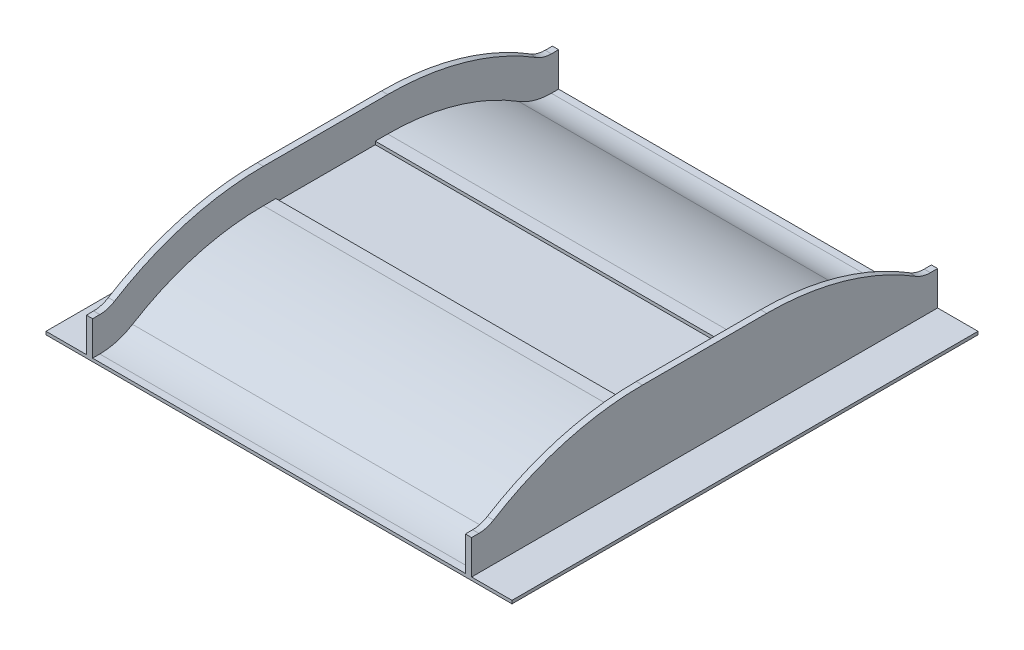
ISO-10303-21;
HEADER;
FILE_DESCRIPTION(('STEP AP214'),'2;1');
FILE_NAME('part.step','',(''),(''),'','','');
FILE_SCHEMA(('AUTOMOTIVE_DESIGN { 1 0 10303 214 1 1 1 1 }'));
ENDSEC;
DATA;
#1=APPLICATION_CONTEXT('core data for automotive mechanical design processes');
#2=APPLICATION_PROTOCOL_DEFINITION('international standard','automotive_design',2000,#1);
#3=PRODUCT_CONTEXT('',#1,'mechanical');
#4=PRODUCT('Part','Part','',(#3));
#5=PRODUCT_RELATED_PRODUCT_CATEGORY('part','',(#4));
#6=PRODUCT_DEFINITION_FORMATION('','',#4);
#7=PRODUCT_DEFINITION_CONTEXT('part definition',#1,'design');
#8=PRODUCT_DEFINITION('design','',#6,#7);
#9=PRODUCT_DEFINITION_SHAPE('','',#8);
#10=(LENGTH_UNIT() NAMED_UNIT(*) SI_UNIT(.MILLI.,.METRE.));
#11=(NAMED_UNIT(*) PLANE_ANGLE_UNIT() SI_UNIT($,.RADIAN.));
#12=(NAMED_UNIT(*) SI_UNIT($,.STERADIAN.) SOLID_ANGLE_UNIT());
#13=UNCERTAINTY_MEASURE_WITH_UNIT(LENGTH_MEASURE(1.E-05),#10,'distance_accuracy_value','');
#14=(GEOMETRIC_REPRESENTATION_CONTEXT(3) GLOBAL_UNCERTAINTY_ASSIGNED_CONTEXT((#13)) GLOBAL_UNIT_ASSIGNED_CONTEXT((#10,
#11,#12)) REPRESENTATION_CONTEXT('',''));
#15=CARTESIAN_POINT('',(0.,0.,0.));
#16=DIRECTION('',(0.,0.,1.));
#17=DIRECTION('',(1.,0.,0.));
#18=AXIS2_PLACEMENT_3D('',#15,#16,#17);
#19=CARTESIAN_POINT('',(2211.28446930371,160.,-3.21673368540825E-13));
#20=DIRECTION('',(0.,-1.,0.));
#21=DIRECTION('',(0.,0.,-1.));
#22=AXIS2_PLACEMENT_3D('',#19,#20,#21);
#23=PLANE('',#22);
#24=DIRECTION('',(0.,0.,1.));
#25=VECTOR('',#24,1.);
#26=CARTESIAN_POINT('',(600.,160.,-6.27465539184419E-13));
#27=LINE('',#26,#25);
#28=CARTESIAN_POINT('',(600.,160.,160.));
#29=VERTEX_POINT('',#28);
#30=CARTESIAN_POINT('',(600.,160.,200.));
#31=VERTEX_POINT('',#30);
#32=EDGE_CURVE('E369',#29,#31,#27,.T.);
#33=ORIENTED_EDGE('',*,*,#32,.F.);
#34=DIRECTION('',(1.,0.,0.));
#35=VECTOR('',#34,1.);
#36=CARTESIAN_POINT('',(-600.,160.,160.));
#37=LINE('',#36,#35);
#38=CARTESIAN_POINT('',(-600.,160.,160.));
#39=VERTEX_POINT('',#38);
#40=EDGE_CURVE('E55',#39,#29,#37,.T.);
#41=ORIENTED_EDGE('',*,*,#40,.F.);
#42=DIRECTION('',(0.,0.,-1.));
#43=VECTOR('',#42,1.);
#44=CARTESIAN_POINT('',(-600.,160.,2.11856741469169E-13));
#45=LINE('',#44,#43);
#46=CARTESIAN_POINT('',(-600.,160.,200.));
#47=VERTEX_POINT('',#46);
#48=EDGE_CURVE('E447',#47,#39,#45,.T.);
#49=ORIENTED_EDGE('',*,*,#48,.F.);
#50=DIRECTION('',(-1.,0.,0.));
#51=VECTOR('',#50,1.);
#52=CARTESIAN_POINT('',(2211.28446930371,160.,200.));
#53=LINE('',#52,#51);
#54=EDGE_CURVE('E469',#31,#47,#53,.T.);
#55=ORIENTED_EDGE('',*,*,#54,.F.);
#56=EDGE_LOOP('',(#33,#41,#49,#55));
#57=FACE_BOUND('',#56,.T.);
#58=ADVANCED_FACE('F40',(#57),#23,.F.);
#59=CARTESIAN_POINT('',(0.,10.,0.));
#60=DIRECTION('',(0.,1.,0.));
#61=DIRECTION('',(0.,0.,1.));
#62=AXIS2_PLACEMENT_3D('',#59,#60,#61);
#63=PLANE('',#62);
#64=DIRECTION('',(1.,0.,0.));
#65=VECTOR('',#64,1.);
#66=CARTESIAN_POINT('',(-750.,10.,750.));
#67=LINE('',#66,#65);
#68=CARTESIAN_POINT('',(-600.,10.,750.));
#69=VERTEX_POINT('',#68);
#70=CARTESIAN_POINT('',(600.,10.,750.));
#71=VERTEX_POINT('',#70);
#72=EDGE_CURVE('E490',#69,#71,#67,.T.);
#73=ORIENTED_EDGE('',*,*,#72,.T.);
#74=DIRECTION('',(0.,0.,1.));
#75=VECTOR('',#74,1.);
#76=CARTESIAN_POINT('',(600.,10.,1.1470400727364E-13));
#77=LINE('',#76,#75);
#78=CARTESIAN_POINT('',(600.,10.0000000000001,726.782687642637));
#79=VERTEX_POINT('',#78);
#80=EDGE_CURVE('E63',#79,#71,#77,.T.);
#81=ORIENTED_EDGE('',*,*,#80,.F.);
#82=DIRECTION('',(-1.,0.,0.));
#83=VECTOR('',#82,1.);
#84=CARTESIAN_POINT('',(2211.28446930371,10.0000000000001,726.782687642636));
#85=LINE('',#84,#83);
#86=CARTESIAN_POINT('',(-600.,10.,726.782687642637));
#87=VERTEX_POINT('',#86);
#88=EDGE_CURVE('E462',#79,#87,#85,.T.);
#89=ORIENTED_EDGE('',*,*,#88,.T.);
#90=DIRECTION('',(0.,0.,1.));
#91=VECTOR('',#90,1.);
#92=CARTESIAN_POINT('',(-600.,10.,1.1470400727364E-13));
#93=LINE('',#92,#91);
#94=EDGE_CURVE('E399',#87,#69,#93,.T.);
#95=ORIENTED_EDGE('',*,*,#94,.T.);
#96=EDGE_LOOP('',(#73,#81,#89,#95));
#97=FACE_BOUND('',#96,.T.);
#98=ADVANCED_FACE('F587',(#97),#63,.T.);
#99=DIRECTION('',(-1.,0.,0.));
#100=VECTOR('',#99,1.);
#101=CARTESIAN_POINT('',(2211.28446930371,10.0000000000001,-726.782687642637));
#102=LINE('',#101,#100);
#103=CARTESIAN_POINT('',(600.,10.0000000000001,-726.782687642637));
#104=VERTEX_POINT('',#103);
#105=CARTESIAN_POINT('',(-600.,10.,-726.782687642637));
#106=VERTEX_POINT('',#105);
#107=EDGE_CURVE('E460',#104,#106,#102,.T.);
#108=ORIENTED_EDGE('',*,*,#107,.F.);
#109=CARTESIAN_POINT('',(600.,10.,-750.));
#110=VERTEX_POINT('',#109);
#111=EDGE_CURVE('E303',#110,#104,#77,.T.);
#112=ORIENTED_EDGE('',*,*,#111,.F.);
#113=DIRECTION('',(-1.,0.,0.));
#114=VECTOR('',#113,1.);
#115=CARTESIAN_POINT('',(-750.,10.,-750.));
#116=LINE('',#115,#114);
#117=CARTESIAN_POINT('',(-600.,10.,-750.));
#118=VERTEX_POINT('',#117);
#119=EDGE_CURVE('E483',#110,#118,#116,.T.);
#120=ORIENTED_EDGE('',*,*,#119,.T.);
#121=EDGE_CURVE('E400',#118,#106,#93,.T.);
#122=ORIENTED_EDGE('',*,*,#121,.T.);
#123=EDGE_LOOP('',(#108,#112,#120,#122));
#124=FACE_BOUND('',#123,.T.);
#125=ADVANCED_FACE('F533',(#124),#63,.T.);
#126=CARTESIAN_POINT('',(2211.28446930371,210.,726.782687642637));
#127=DIRECTION('',(-1.,0.,0.));
#128=DIRECTION('',(0.,0.,1.));
#129=AXIS2_PLACEMENT_3D('',#126,#127,#128);
#130=CYLINDRICAL_SURFACE('',#129,200.);
#131=CARTESIAN_POINT('',(600.,210.,726.782687642637));
#132=DIRECTION('',(1.,0.,0.));
#133=DIRECTION('',(0.,0.,-1.));
#134=AXIS2_PLACEMENT_3D('',#131,#132,#133);
#135=CIRCLE('',#134,200.);
#136=CARTESIAN_POINT('',(600.,40.0000000000005,621.42615011411));
#137=VERTEX_POINT('',#136);
#138=EDGE_CURVE('E374',#137,#79,#135,.F.);
#139=ORIENTED_EDGE('',*,*,#138,.F.);
#140=DIRECTION('',(-1.,0.,0.));
#141=VECTOR('',#140,1.);
#142=CARTESIAN_POINT('',(2211.28446930371,40.0000000000005,621.42615011411));
#143=LINE('',#142,#141);
#144=CARTESIAN_POINT('',(-600.,40.0000000000006,621.42615011411));
#145=VERTEX_POINT('',#144);
#146=EDGE_CURVE('E471',#137,#145,#143,.T.);
#147=ORIENTED_EDGE('',*,*,#146,.T.);
#148=CARTESIAN_POINT('',(-600.,210.,726.782687642637));
#149=DIRECTION('',(-1.,0.,0.));
#150=DIRECTION('',(0.,0.,1.));
#151=AXIS2_PLACEMENT_3D('',#148,#149,#150);
#152=CIRCLE('',#151,200.);
#153=EDGE_CURVE('E453',#87,#145,#152,.F.);
#154=ORIENTED_EDGE('',*,*,#153,.F.);
#155=ORIENTED_EDGE('',*,*,#88,.F.);
#156=EDGE_LOOP('',(#139,#147,#154,#155));
#157=FACE_BOUND('',#156,.T.);
#158=ADVANCED_FACE('F591',(#157),#130,.F.);
#159=CARTESIAN_POINT('',(2211.28446930371,-640.,200.));
#160=DIRECTION('',(-1.,0.,0.));
#161=DIRECTION('',(0.,0.,1.));
#162=AXIS2_PLACEMENT_3D('',#159,#160,#161);
#163=CYLINDRICAL_SURFACE('',#162,800.000000000001);
#164=ORIENTED_EDGE('',*,*,#146,.F.);
#165=CARTESIAN_POINT('',(600.,-640.,200.));
#166=DIRECTION('',(1.,0.,0.));
#167=DIRECTION('',(0.,0.,-1.));
#168=AXIS2_PLACEMENT_3D('',#165,#166,#167);
#169=CIRCLE('',#168,800.000000000001);
#170=EDGE_CURVE('E371',#137,#31,#169,.F.);
#171=ORIENTED_EDGE('',*,*,#170,.T.);
#172=ORIENTED_EDGE('',*,*,#54,.T.);
#173=CARTESIAN_POINT('',(-600.,-640.,200.));
#174=DIRECTION('',(-1.,0.,0.));
#175=DIRECTION('',(0.,0.,1.));
#176=AXIS2_PLACEMENT_3D('',#173,#174,#175);
#177=CIRCLE('',#176,800.000000000001);
#178=EDGE_CURVE('E450',#47,#145,#177,.F.);
#179=ORIENTED_EDGE('',*,*,#178,.T.);
#180=EDGE_LOOP('',(#164,#171,#172,#179));
#181=FACE_BOUND('',#180,.T.);
#182=ADVANCED_FACE('F594',(#181),#163,.T.);
#183=CARTESIAN_POINT('',(-600.,160.,-160.));
#184=VERTEX_POINT('',#183);
#185=CARTESIAN_POINT('',(-600.,160.,-200.));
#186=VERTEX_POINT('',#185);
#187=EDGE_CURVE('E446',#184,#186,#45,.T.);
#188=ORIENTED_EDGE('',*,*,#187,.F.);
#189=DIRECTION('',(-1.,0.,0.));
#190=VECTOR('',#189,1.);
#191=CARTESIAN_POINT('',(-600.,160.,-160.));
#192=LINE('',#191,#190);
#193=CARTESIAN_POINT('',(600.,160.,-160.));
#194=VERTEX_POINT('',#193);
#195=EDGE_CURVE('E287',#194,#184,#192,.T.);
#196=ORIENTED_EDGE('',*,*,#195,.F.);
#197=CARTESIAN_POINT('',(600.,160.,-200.));
#198=VERTEX_POINT('',#197);
#199=EDGE_CURVE('E269',#198,#194,#27,.T.);
#200=ORIENTED_EDGE('',*,*,#199,.F.);
#201=DIRECTION('',(-1.,0.,0.));
#202=VECTOR('',#201,1.);
#203=CARTESIAN_POINT('',(2211.28446930371,160.,-200.));
#204=LINE('',#203,#202);
#205=EDGE_CURVE('E466',#198,#186,#204,.T.);
#206=ORIENTED_EDGE('',*,*,#205,.T.);
#207=EDGE_LOOP('',(#188,#196,#200,#206));
#208=FACE_BOUND('',#207,.T.);
#209=ADVANCED_FACE('F603',(#208),#23,.F.);
#210=CARTESIAN_POINT('',(2211.28446930371,-640.,-200.));
#211=DIRECTION('',(-1.,0.,0.));
#212=DIRECTION('',(0.,0.,1.));
#213=AXIS2_PLACEMENT_3D('',#210,#211,#212);
#214=CYLINDRICAL_SURFACE('',#213,800.);
#215=CARTESIAN_POINT('',(600.,-640.,-200.));
#216=DIRECTION('',(1.,0.,0.));
#217=DIRECTION('',(0.,0.,-1.));
#218=AXIS2_PLACEMENT_3D('',#215,#216,#217);
#219=CIRCLE('',#218,800.);
#220=CARTESIAN_POINT('',(600.,40.,-621.42615011411));
#221=VERTEX_POINT('',#220);
#222=EDGE_CURVE('E367',#221,#198,#219,.T.);
#223=ORIENTED_EDGE('',*,*,#222,.F.);
#224=DIRECTION('',(-1.,0.,0.));
#225=VECTOR('',#224,1.);
#226=CARTESIAN_POINT('',(2211.28446930371,40.,-621.42615011411));
#227=LINE('',#226,#225);
#228=CARTESIAN_POINT('',(-600.,39.9999999999998,-621.426150114109));
#229=VERTEX_POINT('',#228);
#230=EDGE_CURVE('E464',#221,#229,#227,.T.);
#231=ORIENTED_EDGE('',*,*,#230,.T.);
#232=CARTESIAN_POINT('',(-600.,-640.,-200.));
#233=DIRECTION('',(-1.,0.,0.));
#234=DIRECTION('',(0.,0.,1.));
#235=AXIS2_PLACEMENT_3D('',#232,#233,#234);
#236=CIRCLE('',#235,800.);
#237=EDGE_CURVE('E427',#186,#229,#236,.T.);
#238=ORIENTED_EDGE('',*,*,#237,.F.);
#239=ORIENTED_EDGE('',*,*,#205,.F.);
#240=EDGE_LOOP('',(#223,#231,#238,#239));
#241=FACE_BOUND('',#240,.T.);
#242=ADVANCED_FACE('F606',(#241),#214,.T.);
#243=CARTESIAN_POINT('',(2211.28446930371,210.,-726.782687642637));
#244=DIRECTION('',(-1.,0.,0.));
#245=DIRECTION('',(0.,0.,1.));
#246=AXIS2_PLACEMENT_3D('',#243,#244,#245);
#247=CYLINDRICAL_SURFACE('',#246,200.);
#248=ORIENTED_EDGE('',*,*,#230,.F.);
#249=CARTESIAN_POINT('',(600.,210.,-726.782687642637));
#250=DIRECTION('',(1.,0.,0.));
#251=DIRECTION('',(0.,0.,-1.));
#252=AXIS2_PLACEMENT_3D('',#249,#250,#251);
#253=CIRCLE('',#252,200.);
#254=EDGE_CURVE('E351',#221,#104,#253,.T.);
#255=ORIENTED_EDGE('',*,*,#254,.T.);
#256=ORIENTED_EDGE('',*,*,#107,.T.);
#257=CARTESIAN_POINT('',(-600.,210.,-726.782687642637));
#258=DIRECTION('',(-1.,0.,0.));
#259=DIRECTION('',(0.,0.,1.));
#260=AXIS2_PLACEMENT_3D('',#257,#258,#259);
#261=CIRCLE('',#260,200.);
#262=EDGE_CURVE('E12',#106,#229,#261,.T.);
#263=ORIENTED_EDGE('',*,*,#262,.T.);
#264=EDGE_LOOP('',(#248,#255,#256,#263));
#265=FACE_BOUND('',#264,.T.);
#266=ADVANCED_FACE('F545',(#265),#247,.F.);
#267=DIRECTION('',(0.,0.,-1.));
#268=VECTOR('',#267,1.);
#269=CARTESIAN_POINT('',(620.,10.0000000000001,0.));
#270=LINE('',#269,#268);
#271=CARTESIAN_POINT('',(620.,10.,750.));
#272=VERTEX_POINT('',#271);
#273=CARTESIAN_POINT('',(620.,10.,-750.));
#274=VERTEX_POINT('',#273);
#275=EDGE_CURVE('E457',#272,#274,#270,.T.);
#276=ORIENTED_EDGE('',*,*,#275,.F.);
#277=CARTESIAN_POINT('',(750.,10.,750.));
#278=VERTEX_POINT('',#277);
#279=EDGE_CURVE('E485',#272,#278,#67,.T.);
#280=ORIENTED_EDGE('',*,*,#279,.T.);
#281=DIRECTION('',(0.,0.,-1.));
#282=VECTOR('',#281,1.);
#283=CARTESIAN_POINT('',(750.,10.,-750.));
#284=LINE('',#283,#282);
#285=CARTESIAN_POINT('',(750.,10.,-750.));
#286=VERTEX_POINT('',#285);
#287=EDGE_CURVE('E474',#278,#286,#284,.T.);
#288=ORIENTED_EDGE('',*,*,#287,.T.);
#289=EDGE_CURVE('E479',#286,#274,#116,.T.);
#290=ORIENTED_EDGE('',*,*,#289,.T.);
#291=EDGE_LOOP('',(#276,#280,#288,#290));
#292=FACE_BOUND('',#291,.T.);
#293=ADVANCED_FACE('F613',(#292),#63,.T.);
#294=CARTESIAN_POINT('',(750.,10.,-750.));
#295=DIRECTION('',(-1.,0.,0.));
#296=DIRECTION('',(0.,0.,1.));
#297=AXIS2_PLACEMENT_3D('',#294,#295,#296);
#298=PLANE('',#297);
#299=DIRECTION('',(0.,0.,-1.));
#300=VECTOR('',#299,1.);
#301=CARTESIAN_POINT('',(750.,0.,-750.));
#302=LINE('',#301,#300);
#303=CARTESIAN_POINT('',(750.,0.,750.));
#304=VERTEX_POINT('',#303);
#305=CARTESIAN_POINT('',(750.,0.,-750.));
#306=VERTEX_POINT('',#305);
#307=EDGE_CURVE('E459',#304,#306,#302,.T.);
#308=ORIENTED_EDGE('',*,*,#307,.T.);
#309=DIRECTION('',(0.,-1.,0.));
#310=VECTOR('',#309,1.);
#311=CARTESIAN_POINT('',(750.,10.,-750.));
#312=LINE('',#311,#310);
#313=EDGE_CURVE('E48',#286,#306,#312,.T.);
#314=ORIENTED_EDGE('',*,*,#313,.F.);
#315=ORIENTED_EDGE('',*,*,#287,.F.);
#316=DIRECTION('',(0.,-1.,0.));
#317=VECTOR('',#316,1.);
#318=CARTESIAN_POINT('',(750.,10.,750.));
#319=LINE('',#318,#317);
#320=EDGE_CURVE('E489',#278,#304,#319,.T.);
#321=ORIENTED_EDGE('',*,*,#320,.T.);
#322=EDGE_LOOP('',(#308,#314,#315,#321));
#323=FACE_BOUND('',#322,.T.);
#324=ADVANCED_FACE('F42',(#323),#298,.F.);
#325=CARTESIAN_POINT('',(-750.,10.,-750.));
#326=DIRECTION('',(0.,0.,1.));
#327=DIRECTION('',(1.,0.,0.));
#328=AXIS2_PLACEMENT_3D('',#325,#326,#327);
#329=PLANE('',#328);
#330=DIRECTION('',(-1.,0.,0.));
#331=VECTOR('',#330,1.);
#332=CARTESIAN_POINT('',(-750.,0.,-750.));
#333=LINE('',#332,#331);
#334=CARTESIAN_POINT('',(-750.,0.,-750.));
#335=VERTEX_POINT('',#334);
#336=EDGE_CURVE('E493',#306,#335,#333,.T.);
#337=ORIENTED_EDGE('',*,*,#336,.T.);
#338=DIRECTION('',(0.,-1.,0.));
#339=VECTOR('',#338,1.);
#340=CARTESIAN_POINT('',(-750.,10.,-750.));
#341=LINE('',#340,#339);
#342=CARTESIAN_POINT('',(-750.,10.,-750.));
#343=VERTEX_POINT('',#342);
#344=EDGE_CURVE('E503',#343,#335,#341,.T.);
#345=ORIENTED_EDGE('',*,*,#344,.F.);
#346=CARTESIAN_POINT('',(-620.,10.,-750.));
#347=VERTEX_POINT('',#346);
#348=EDGE_CURVE('E477',#347,#343,#116,.T.);
#349=ORIENTED_EDGE('',*,*,#348,.F.);
#350=DIRECTION('',(0.,-1.,0.));
#351=VECTOR('',#350,1.);
#352=CARTESIAN_POINT('',(-620.,0.,-750.));
#353=LINE('',#352,#351);
#354=CARTESIAN_POINT('',(-620.,120.,-750.));
#355=VERTEX_POINT('',#354);
#356=EDGE_CURVE('E381',#355,#347,#353,.T.);
#357=ORIENTED_EDGE('',*,*,#356,.F.);
#358=DIRECTION('',(-1.,0.,0.));
#359=VECTOR('',#358,1.);
#360=CARTESIAN_POINT('',(-600.,120.,-750.));
#361=LINE('',#360,#359);
#362=CARTESIAN_POINT('',(-600.,120.,-750.));
#363=VERTEX_POINT('',#362);
#364=EDGE_CURVE('E425',#363,#355,#361,.T.);
#365=ORIENTED_EDGE('',*,*,#364,.F.);
#366=DIRECTION('',(0.,-1.,0.));
#367=VECTOR('',#366,1.);
#368=CARTESIAN_POINT('',(-600.,0.,-750.));
#369=LINE('',#368,#367);
#370=EDGE_CURVE('E396',#363,#118,#369,.T.);
#371=ORIENTED_EDGE('',*,*,#370,.T.);
#372=ORIENTED_EDGE('',*,*,#119,.F.);
#373=DIRECTION('',(0.,-1.,0.));
#374=VECTOR('',#373,1.);
#375=CARTESIAN_POINT('',(600.,0.,-750.));
#376=LINE('',#375,#374);
#377=CARTESIAN_POINT('',(600.,120.,-750.));
#378=VERTEX_POINT('',#377);
#379=EDGE_CURVE('E306',#378,#110,#376,.T.);
#380=ORIENTED_EDGE('',*,*,#379,.F.);
#381=DIRECTION('',(1.,0.,0.));
#382=VECTOR('',#381,1.);
#383=CARTESIAN_POINT('',(600.,120.,-750.));
#384=LINE('',#383,#382);
#385=CARTESIAN_POINT('',(620.,120.,-750.));
#386=VERTEX_POINT('',#385);
#387=EDGE_CURVE('E364',#378,#386,#384,.T.);
#388=ORIENTED_EDGE('',*,*,#387,.T.);
#389=DIRECTION('',(0.,-1.,0.));
#390=VECTOR('',#389,1.);
#391=CARTESIAN_POINT('',(620.,0.,-750.));
#392=LINE('',#391,#390);
#393=EDGE_CURVE('E328',#386,#274,#392,.T.);
#394=ORIENTED_EDGE('',*,*,#393,.T.);
#395=ORIENTED_EDGE('',*,*,#289,.F.);
#396=ORIENTED_EDGE('',*,*,#313,.T.);
#397=EDGE_LOOP('',(#337,#345,#349,#357,#365,#371,#372,#380,#388,#394,#395,#396));
#398=FACE_BOUND('',#397,.T.);
#399=ADVANCED_FACE('F508',(#398),#329,.F.);
#400=CARTESIAN_POINT('',(-750.,10.,-750.));
#401=DIRECTION('',(1.,0.,0.));
#402=DIRECTION('',(0.,0.,-1.));
#403=AXIS2_PLACEMENT_3D('',#400,#401,#402);
#404=PLANE('',#403);
#405=DIRECTION('',(0.,0.,1.));
#406=VECTOR('',#405,1.);
#407=CARTESIAN_POINT('',(-750.,0.,-750.));
#408=LINE('',#407,#406);
#409=CARTESIAN_POINT('',(-750.,0.,750.));
#410=VERTEX_POINT('',#409);
#411=EDGE_CURVE('E495',#335,#410,#408,.T.);
#412=ORIENTED_EDGE('',*,*,#411,.T.);
#413=DIRECTION('',(0.,-1.,0.));
#414=VECTOR('',#413,1.);
#415=CARTESIAN_POINT('',(-750.,10.,750.));
#416=LINE('',#415,#414);
#417=CARTESIAN_POINT('',(-750.,10.,750.));
#418=VERTEX_POINT('',#417);
#419=EDGE_CURVE('E500',#418,#410,#416,.T.);
#420=ORIENTED_EDGE('',*,*,#419,.F.);
#421=DIRECTION('',(0.,0.,1.));
#422=VECTOR('',#421,1.);
#423=CARTESIAN_POINT('',(-750.,10.,-750.));
#424=LINE('',#423,#422);
#425=EDGE_CURVE('E482',#343,#418,#424,.T.);
#426=ORIENTED_EDGE('',*,*,#425,.F.);
#427=ORIENTED_EDGE('',*,*,#344,.T.);
#428=EDGE_LOOP('',(#412,#420,#426,#427));
#429=FACE_BOUND('',#428,.T.);
#430=ADVANCED_FACE('F520',(#429),#404,.F.);
#431=CARTESIAN_POINT('',(-750.,10.,750.));
#432=DIRECTION('',(0.,0.,-1.));
#433=DIRECTION('',(-1.,0.,0.));
#434=AXIS2_PLACEMENT_3D('',#431,#432,#433);
#435=PLANE('',#434);
#436=DIRECTION('',(1.,0.,0.));
#437=VECTOR('',#436,1.);
#438=CARTESIAN_POINT('',(-750.,0.,750.));
#439=LINE('',#438,#437);
#440=EDGE_CURVE('E478',#410,#304,#439,.T.);
#441=ORIENTED_EDGE('',*,*,#440,.T.);
#442=ORIENTED_EDGE('',*,*,#320,.F.);
#443=ORIENTED_EDGE('',*,*,#279,.F.);
#444=DIRECTION('',(0.,-1.,0.));
#445=VECTOR('',#444,1.);
#446=CARTESIAN_POINT('',(620.,0.,750.));
#447=LINE('',#446,#445);
#448=CARTESIAN_POINT('',(620.,120.,750.));
#449=VERTEX_POINT('',#448);
#450=EDGE_CURVE('E295',#449,#272,#447,.T.);
#451=ORIENTED_EDGE('',*,*,#450,.F.);
#452=DIRECTION('',(1.,0.,0.));
#453=VECTOR('',#452,1.);
#454=CARTESIAN_POINT('',(600.,120.,750.));
#455=LINE('',#454,#453);
#456=CARTESIAN_POINT('',(600.,120.,750.));
#457=VERTEX_POINT('',#456);
#458=EDGE_CURVE('E349',#457,#449,#455,.T.);
#459=ORIENTED_EDGE('',*,*,#458,.F.);
#460=DIRECTION('',(0.,-1.,0.));
#461=VECTOR('',#460,1.);
#462=CARTESIAN_POINT('',(600.,0.,750.));
#463=LINE('',#462,#461);
#464=EDGE_CURVE('E299',#457,#71,#463,.T.);
#465=ORIENTED_EDGE('',*,*,#464,.T.);
#466=ORIENTED_EDGE('',*,*,#72,.F.);
#467=DIRECTION('',(0.,-1.,0.));
#468=VECTOR('',#467,1.);
#469=CARTESIAN_POINT('',(-600.,0.,750.));
#470=LINE('',#469,#468);
#471=CARTESIAN_POINT('',(-600.,120.,750.));
#472=VERTEX_POINT('',#471);
#473=EDGE_CURVE('E378',#472,#69,#470,.T.);
#474=ORIENTED_EDGE('',*,*,#473,.F.);
#475=DIRECTION('',(-1.,0.,0.));
#476=VECTOR('',#475,1.);
#477=CARTESIAN_POINT('',(-600.,120.,750.));
#478=LINE('',#477,#476);
#479=CARTESIAN_POINT('',(-620.,120.,750.));
#480=VERTEX_POINT('',#479);
#481=EDGE_CURVE('E403',#472,#480,#478,.T.);
#482=ORIENTED_EDGE('',*,*,#481,.T.);
#483=DIRECTION('',(0.,-1.,0.));
#484=VECTOR('',#483,1.);
#485=CARTESIAN_POINT('',(-620.,0.,750.));
#486=LINE('',#485,#484);
#487=CARTESIAN_POINT('',(-620.,10.,750.));
#488=VERTEX_POINT('',#487);
#489=EDGE_CURVE('E377',#480,#488,#486,.T.);
#490=ORIENTED_EDGE('',*,*,#489,.T.);
#491=EDGE_CURVE('E486',#418,#488,#67,.T.);
#492=ORIENTED_EDGE('',*,*,#491,.F.);
#493=ORIENTED_EDGE('',*,*,#419,.T.);
#494=EDGE_LOOP('',(#441,#442,#443,#451,#459,#465,#466,#474,#482,#490,#492,#493));
#495=FACE_BOUND('',#494,.T.);
#496=ADVANCED_FACE('F524',(#495),#435,.F.);
#497=DIRECTION('',(0.,0.,1.));
#498=VECTOR('',#497,1.);
#499=CARTESIAN_POINT('',(-620.,10.0000000000001,0.));
#500=LINE('',#499,#498);
#501=EDGE_CURVE('E456',#347,#488,#500,.T.);
#502=ORIENTED_EDGE('',*,*,#501,.F.);
#503=ORIENTED_EDGE('',*,*,#348,.T.);
#504=ORIENTED_EDGE('',*,*,#425,.T.);
#505=ORIENTED_EDGE('',*,*,#491,.T.);
#506=EDGE_LOOP('',(#502,#503,#504,#505));
#507=FACE_BOUND('',#506,.T.);
#508=ADVANCED_FACE('F527',(#507),#63,.T.);
#509=CARTESIAN_POINT('',(0.,0.,0.));
#510=DIRECTION('',(0.,1.,0.));
#511=DIRECTION('',(0.,0.,1.));
#512=AXIS2_PLACEMENT_3D('',#509,#510,#511);
#513=PLANE('',#512);
#514=ORIENTED_EDGE('',*,*,#307,.F.);
#515=ORIENTED_EDGE('',*,*,#440,.F.);
#516=ORIENTED_EDGE('',*,*,#411,.F.);
#517=ORIENTED_EDGE('',*,*,#336,.F.);
#518=EDGE_LOOP('',(#514,#515,#516,#517));
#519=FACE_BOUND('',#518,.T.);
#520=ADVANCED_FACE('F516',(#519),#513,.F.);
#521=CARTESIAN_POINT('',(-620.,0.,0.));
#522=DIRECTION('',(-1.,0.,0.));
#523=DIRECTION('',(0.,0.,1.));
#524=AXIS2_PLACEMENT_3D('',#521,#522,#523);
#525=PLANE('',#524);
#526=ORIENTED_EDGE('',*,*,#501,.T.);
#527=ORIENTED_EDGE('',*,*,#489,.F.);
#528=DIRECTION('',(0.,0.,1.));
#529=VECTOR('',#528,1.);
#530=CARTESIAN_POINT('',(-620.,120.,1.17664602005974E-13));
#531=LINE('',#530,#529);
#532=CARTESIAN_POINT('',(-620.,120.,726.782687642637));
#533=VERTEX_POINT('',#532);
#534=EDGE_CURVE('E406',#533,#480,#531,.T.);
#535=ORIENTED_EDGE('',*,*,#534,.F.);
#536=CARTESIAN_POINT('',(-620.,210.,726.782687642637));
#537=DIRECTION('',(-1.,0.,0.));
#538=DIRECTION('',(0.,0.,1.));
#539=AXIS2_PLACEMENT_3D('',#536,#537,#538);
#540=CIRCLE('',#539,89.9999999999997);
#541=CARTESIAN_POINT('',(-620.,133.5,679.3722457548));
#542=VERTEX_POINT('',#541);
#543=EDGE_CURVE('E408',#542,#533,#540,.T.);
#544=ORIENTED_EDGE('',*,*,#543,.F.);
#545=CARTESIAN_POINT('',(-620.,-640.,200.));
#546=DIRECTION('',(-1.,0.,0.));
#547=DIRECTION('',(0.,0.,1.));
#548=AXIS2_PLACEMENT_3D('',#545,#546,#547);
#549=CIRCLE('',#548,910.);
#550=CARTESIAN_POINT('',(-620.,270.,200.));
#551=VERTEX_POINT('',#550);
#552=EDGE_CURVE('E411',#542,#551,#549,.T.);
#553=ORIENTED_EDGE('',*,*,#552,.T.);
#554=DIRECTION('',(0.,0.,1.));
#555=VECTOR('',#554,1.);
#556=CARTESIAN_POINT('',(-620.,270.,-1.0715556048062E-13));
#557=LINE('',#556,#555);
#558=CARTESIAN_POINT('',(-620.,270.,-200.));
#559=VERTEX_POINT('',#558);
#560=EDGE_CURVE('E414',#559,#551,#557,.T.);
#561=ORIENTED_EDGE('',*,*,#560,.F.);
#562=CARTESIAN_POINT('',(-620.,-640.,-200.));
#563=DIRECTION('',(-1.,0.,0.));
#564=DIRECTION('',(0.,0.,1.));
#565=AXIS2_PLACEMENT_3D('',#562,#563,#564);
#566=CIRCLE('',#565,910.);
#567=CARTESIAN_POINT('',(-620.,133.5,-679.3722457548));
#568=VERTEX_POINT('',#567);
#569=EDGE_CURVE('E417',#559,#568,#566,.T.);
#570=ORIENTED_EDGE('',*,*,#569,.T.);
#571=CARTESIAN_POINT('',(-620.,210.,-726.782687642637));
#572=DIRECTION('',(-1.,0.,0.));
#573=DIRECTION('',(0.,0.,1.));
#574=AXIS2_PLACEMENT_3D('',#571,#572,#573);
#575=CIRCLE('',#574,89.9999999999999);
#576=CARTESIAN_POINT('',(-620.,120.,-726.782687642637));
#577=VERTEX_POINT('',#576);
#578=EDGE_CURVE('E420',#577,#568,#575,.T.);
#579=ORIENTED_EDGE('',*,*,#578,.F.);
#580=EDGE_CURVE('E409',#355,#577,#531,.T.);
#581=ORIENTED_EDGE('',*,*,#580,.F.);
#582=ORIENTED_EDGE('',*,*,#356,.T.);
#583=EDGE_LOOP('',(#526,#527,#535,#544,#553,#561,#570,#579,#581,#582));
#584=FACE_BOUND('',#583,.T.);
#585=ADVANCED_FACE('F629',(#584),#525,.T.);
#586=CARTESIAN_POINT('',(620.,10.,-750.));
#587=DIRECTION('',(-1.,0.,0.));
#588=DIRECTION('',(0.,0.,1.));
#589=AXIS2_PLACEMENT_3D('',#586,#587,#588);
#590=PLANE('',#589);
#591=ORIENTED_EDGE('',*,*,#450,.T.);
#592=ORIENTED_EDGE('',*,*,#275,.T.);
#593=ORIENTED_EDGE('',*,*,#393,.F.);
#594=DIRECTION('',(0.,0.,1.));
#595=VECTOR('',#594,1.);
#596=CARTESIAN_POINT('',(620.,120.,1.17664602005974E-13));
#597=LINE('',#596,#595);
#598=CARTESIAN_POINT('',(620.,120.,-726.782687642637));
#599=VERTEX_POINT('',#598);
#600=EDGE_CURVE('E331',#386,#599,#597,.T.);
#601=ORIENTED_EDGE('',*,*,#600,.T.);
#602=CARTESIAN_POINT('',(620.,210.,-726.782687642637));
#603=DIRECTION('',(-1.,0.,0.));
#604=DIRECTION('',(0.,0.,1.));
#605=AXIS2_PLACEMENT_3D('',#602,#603,#604);
#606=CIRCLE('',#605,89.9999999999999);
#607=CARTESIAN_POINT('',(620.,133.5,-679.3722457548));
#608=VERTEX_POINT('',#607);
#609=EDGE_CURVE('E334',#599,#608,#606,.T.);
#610=ORIENTED_EDGE('',*,*,#609,.T.);
#611=CARTESIAN_POINT('',(620.,-640.,-200.));
#612=DIRECTION('',(-1.,0.,0.));
#613=DIRECTION('',(0.,0.,1.));
#614=AXIS2_PLACEMENT_3D('',#611,#612,#613);
#615=CIRCLE('',#614,910.);
#616=CARTESIAN_POINT('',(620.,270.,-200.));
#617=VERTEX_POINT('',#616);
#618=EDGE_CURVE('E337',#617,#608,#615,.T.);
#619=ORIENTED_EDGE('',*,*,#618,.F.);
#620=DIRECTION('',(0.,0.,1.));
#621=VECTOR('',#620,1.);
#622=CARTESIAN_POINT('',(620.,270.,-1.0715556048062E-13));
#623=LINE('',#622,#621);
#624=CARTESIAN_POINT('',(620.,270.,200.));
#625=VERTEX_POINT('',#624);
#626=EDGE_CURVE('E340',#617,#625,#623,.T.);
#627=ORIENTED_EDGE('',*,*,#626,.T.);
#628=CARTESIAN_POINT('',(620.,-640.,200.));
#629=DIRECTION('',(-1.,0.,0.));
#630=DIRECTION('',(0.,0.,1.));
#631=AXIS2_PLACEMENT_3D('',#628,#629,#630);
#632=CIRCLE('',#631,910.);
#633=CARTESIAN_POINT('',(620.,133.5,679.3722457548));
#634=VERTEX_POINT('',#633);
#635=EDGE_CURVE('E343',#634,#625,#632,.T.);
#636=ORIENTED_EDGE('',*,*,#635,.F.);
#637=CARTESIAN_POINT('',(620.,210.,726.782687642637));
#638=DIRECTION('',(-1.,0.,0.));
#639=DIRECTION('',(0.,0.,1.));
#640=AXIS2_PLACEMENT_3D('',#637,#638,#639);
#641=CIRCLE('',#640,89.9999999999997);
#642=CARTESIAN_POINT('',(620.,120.,726.782687642637));
#643=VERTEX_POINT('',#642);
#644=EDGE_CURVE('E346',#634,#643,#641,.T.);
#645=ORIENTED_EDGE('',*,*,#644,.T.);
#646=EDGE_CURVE('E302',#643,#449,#597,.T.);
#647=ORIENTED_EDGE('',*,*,#646,.T.);
#648=EDGE_LOOP('',(#591,#592,#593,#601,#610,#619,#627,#636,#645,#647));
#649=FACE_BOUND('',#648,.T.);
#650=ADVANCED_FACE('F553',(#649),#590,.F.);
#651=CARTESIAN_POINT('',(-600.,120.,1.1470400727364E-13));
#652=DIRECTION('',(0.,-1.,0.));
#653=DIRECTION('',(0.,0.,-1.));
#654=AXIS2_PLACEMENT_3D('',#651,#652,#653);
#655=PLANE('',#654);
#656=ORIENTED_EDGE('',*,*,#580,.T.);
#657=DIRECTION('',(-1.,0.,0.));
#658=VECTOR('',#657,1.);
#659=CARTESIAN_POINT('',(-600.,120.,-726.782687642637));
#660=LINE('',#659,#658);
#661=CARTESIAN_POINT('',(-600.,120.,-726.782687642637));
#662=VERTEX_POINT('',#661);
#663=EDGE_CURVE('E428',#662,#577,#660,.T.);
#664=ORIENTED_EDGE('',*,*,#663,.F.);
#665=DIRECTION('',(0.,0.,1.));
#666=VECTOR('',#665,1.);
#667=CARTESIAN_POINT('',(-600.,120.,1.1470400727364E-13));
#668=LINE('',#667,#666);
#669=EDGE_CURVE('E384',#363,#662,#668,.T.);
#670=ORIENTED_EDGE('',*,*,#669,.F.);
#671=ORIENTED_EDGE('',*,*,#364,.T.);
#672=EDGE_LOOP('',(#656,#664,#670,#671));
#673=FACE_BOUND('',#672,.T.);
#674=ADVANCED_FACE('F705',(#673),#655,.F.);
#675=CARTESIAN_POINT('',(-600.,210.,-726.782687642637));
#676=DIRECTION('',(-1.,0.,0.));
#677=DIRECTION('',(0.,0.,1.));
#678=AXIS2_PLACEMENT_3D('',#675,#676,#677);
#679=CYLINDRICAL_SURFACE('',#678,89.9999999999999);
#680=ORIENTED_EDGE('',*,*,#578,.T.);
#681=DIRECTION('',(-1.,0.,0.));
#682=VECTOR('',#681,1.);
#683=CARTESIAN_POINT('',(-600.,133.5,-679.3722457548));
#684=LINE('',#683,#682);
#685=CARTESIAN_POINT('',(-600.,133.5,-679.3722457548));
#686=VERTEX_POINT('',#685);
#687=EDGE_CURVE('E431',#686,#568,#684,.T.);
#688=ORIENTED_EDGE('',*,*,#687,.F.);
#689=CARTESIAN_POINT('',(-600.,210.,-726.782687642637));
#690=DIRECTION('',(-1.,0.,0.));
#691=DIRECTION('',(0.,0.,1.));
#692=AXIS2_PLACEMENT_3D('',#689,#690,#691);
#693=CIRCLE('',#692,89.9999999999999);
#694=EDGE_CURVE('E394',#662,#686,#693,.T.);
#695=ORIENTED_EDGE('',*,*,#694,.F.);
#696=ORIENTED_EDGE('',*,*,#663,.T.);
#697=EDGE_LOOP('',(#680,#688,#695,#696));
#698=FACE_BOUND('',#697,.T.);
#699=ADVANCED_FACE('F821',(#698),#679,.F.);
#700=CARTESIAN_POINT('',(-600.,-640.,-200.));
#701=DIRECTION('',(-1.,0.,0.));
#702=DIRECTION('',(0.,0.,1.));
#703=AXIS2_PLACEMENT_3D('',#700,#701,#702);
#704=CYLINDRICAL_SURFACE('',#703,910.);
#705=ORIENTED_EDGE('',*,*,#569,.F.);
#706=DIRECTION('',(-1.,0.,0.));
#707=VECTOR('',#706,1.);
#708=CARTESIAN_POINT('',(-600.,270.,-200.));
#709=LINE('',#708,#707);
#710=CARTESIAN_POINT('',(-600.,270.,-200.));
#711=VERTEX_POINT('',#710);
#712=EDGE_CURVE('E433',#711,#559,#709,.T.);
#713=ORIENTED_EDGE('',*,*,#712,.F.);
#714=CARTESIAN_POINT('',(-600.,-640.,-200.));
#715=DIRECTION('',(-1.,0.,0.));
#716=DIRECTION('',(0.,0.,1.));
#717=AXIS2_PLACEMENT_3D('',#714,#715,#716);
#718=CIRCLE('',#717,910.);
#719=EDGE_CURVE('E391',#711,#686,#718,.T.);
#720=ORIENTED_EDGE('',*,*,#719,.T.);
#721=ORIENTED_EDGE('',*,*,#687,.T.);
#722=EDGE_LOOP('',(#705,#713,#720,#721));
#723=FACE_BOUND('',#722,.T.);
#724=ADVANCED_FACE('F825',(#723),#704,.T.);
#725=CARTESIAN_POINT('',(-600.,270.,-1.10116155212954E-13));
#726=DIRECTION('',(0.,-1.,0.));
#727=DIRECTION('',(0.,0.,-1.));
#728=AXIS2_PLACEMENT_3D('',#725,#726,#727);
#729=PLANE('',#728);
#730=ORIENTED_EDGE('',*,*,#560,.T.);
#731=DIRECTION('',(-1.,0.,0.));
#732=VECTOR('',#731,1.);
#733=CARTESIAN_POINT('',(-600.,270.,200.));
#734=LINE('',#733,#732);
#735=CARTESIAN_POINT('',(-600.,270.,200.));
#736=VERTEX_POINT('',#735);
#737=EDGE_CURVE('E435',#736,#551,#734,.T.);
#738=ORIENTED_EDGE('',*,*,#737,.F.);
#739=DIRECTION('',(0.,0.,1.));
#740=VECTOR('',#739,1.);
#741=CARTESIAN_POINT('',(-600.,270.,-1.10116155212954E-13));
#742=LINE('',#741,#740);
#743=EDGE_CURVE('E389',#711,#736,#742,.T.);
#744=ORIENTED_EDGE('',*,*,#743,.F.);
#745=ORIENTED_EDGE('',*,*,#712,.T.);
#746=EDGE_LOOP('',(#730,#738,#744,#745));
#747=FACE_BOUND('',#746,.T.);
#748=ADVANCED_FACE('F829',(#747),#729,.F.);
#749=CARTESIAN_POINT('',(-600.,-640.,200.));
#750=DIRECTION('',(-1.,0.,0.));
#751=DIRECTION('',(0.,0.,1.));
#752=AXIS2_PLACEMENT_3D('',#749,#750,#751);
#753=CYLINDRICAL_SURFACE('',#752,910.);
#754=ORIENTED_EDGE('',*,*,#552,.F.);
#755=DIRECTION('',(-1.,0.,0.));
#756=VECTOR('',#755,1.);
#757=CARTESIAN_POINT('',(-600.,133.5,679.3722457548));
#758=LINE('',#757,#756);
#759=CARTESIAN_POINT('',(-600.,133.5,679.3722457548));
#760=VERTEX_POINT('',#759);
#761=EDGE_CURVE('E437',#760,#542,#758,.T.);
#762=ORIENTED_EDGE('',*,*,#761,.F.);
#763=CARTESIAN_POINT('',(-600.,-640.,200.));
#764=DIRECTION('',(-1.,0.,0.));
#765=DIRECTION('',(0.,0.,1.));
#766=AXIS2_PLACEMENT_3D('',#763,#764,#765);
#767=CIRCLE('',#766,910.);
#768=EDGE_CURVE('E386',#760,#736,#767,.T.);
#769=ORIENTED_EDGE('',*,*,#768,.T.);
#770=ORIENTED_EDGE('',*,*,#737,.T.);
#771=EDGE_LOOP('',(#754,#762,#769,#770));
#772=FACE_BOUND('',#771,.T.);
#773=ADVANCED_FACE('F833',(#772),#753,.T.);
#774=CARTESIAN_POINT('',(-600.,210.,726.782687642637));
#775=DIRECTION('',(-1.,0.,0.));
#776=DIRECTION('',(0.,0.,1.));
#777=AXIS2_PLACEMENT_3D('',#774,#775,#776);
#778=CYLINDRICAL_SURFACE('',#777,89.9999999999997);
#779=ORIENTED_EDGE('',*,*,#543,.T.);
#780=DIRECTION('',(-1.,0.,0.));
#781=VECTOR('',#780,1.);
#782=CARTESIAN_POINT('',(-600.,120.,726.782687642637));
#783=LINE('',#782,#781);
#784=CARTESIAN_POINT('',(-600.,120.,726.782687642637));
#785=VERTEX_POINT('',#784);
#786=EDGE_CURVE('E439',#785,#533,#783,.T.);
#787=ORIENTED_EDGE('',*,*,#786,.F.);
#788=CARTESIAN_POINT('',(-600.,210.,726.782687642637));
#789=DIRECTION('',(-1.,0.,0.));
#790=DIRECTION('',(0.,0.,1.));
#791=AXIS2_PLACEMENT_3D('',#788,#789,#790);
#792=CIRCLE('',#791,89.9999999999997);
#793=EDGE_CURVE('E383',#760,#785,#792,.T.);
#794=ORIENTED_EDGE('',*,*,#793,.F.);
#795=ORIENTED_EDGE('',*,*,#761,.T.);
#796=EDGE_LOOP('',(#779,#787,#794,#795));
#797=FACE_BOUND('',#796,.T.);
#798=ADVANCED_FACE('F837',(#797),#778,.F.);
#799=ORIENTED_EDGE('',*,*,#534,.T.);
#800=ORIENTED_EDGE('',*,*,#481,.F.);
#801=EDGE_CURVE('E380',#785,#472,#668,.T.);
#802=ORIENTED_EDGE('',*,*,#801,.F.);
#803=ORIENTED_EDGE('',*,*,#786,.T.);
#804=EDGE_LOOP('',(#799,#800,#802,#803));
#805=FACE_BOUND('',#804,.T.);
#806=ADVANCED_FACE('F782',(#805),#655,.F.);
#807=CARTESIAN_POINT('',(-600.,0.,1.1470400727364E-13));
#808=DIRECTION('',(-1.,0.,0.));
#809=DIRECTION('',(0.,0.,1.));
#810=AXIS2_PLACEMENT_3D('',#807,#808,#809);
#811=PLANE('',#810);
#812=ORIENTED_EDGE('',*,*,#94,.F.);
#813=ORIENTED_EDGE('',*,*,#153,.T.);
#814=ORIENTED_EDGE('',*,*,#178,.F.);
#815=ORIENTED_EDGE('',*,*,#48,.T.);
#816=DIRECTION('',(0.,1.,0.));
#817=VECTOR('',#816,1.);
#818=CARTESIAN_POINT('',(-600.,150.,160.));
#819=LINE('',#818,#817);
#820=CARTESIAN_POINT('',(-600.,150.,160.));
#821=VERTEX_POINT('',#820);
#822=EDGE_CURVE('E296',#821,#39,#819,.T.);
#823=ORIENTED_EDGE('',*,*,#822,.F.);
#824=DIRECTION('',(0.,0.,1.));
#825=VECTOR('',#824,1.);
#826=CARTESIAN_POINT('',(-600.,150.,-160.));
#827=LINE('',#826,#825);
#828=CARTESIAN_POINT('',(-600.,150.,-160.));
#829=VERTEX_POINT('',#828);
#830=EDGE_CURVE('E282',#829,#821,#827,.T.);
#831=ORIENTED_EDGE('',*,*,#830,.F.);
#832=DIRECTION('',(0.,1.,0.));
#833=VECTOR('',#832,1.);
#834=CARTESIAN_POINT('',(-600.,150.,-160.));
#835=LINE('',#834,#833);
#836=EDGE_CURVE('E273',#829,#184,#835,.T.);
#837=ORIENTED_EDGE('',*,*,#836,.T.);
#838=ORIENTED_EDGE('',*,*,#187,.T.);
#839=ORIENTED_EDGE('',*,*,#237,.T.);
#840=ORIENTED_EDGE('',*,*,#262,.F.);
#841=ORIENTED_EDGE('',*,*,#121,.F.);
#842=ORIENTED_EDGE('',*,*,#370,.F.);
#843=ORIENTED_EDGE('',*,*,#669,.T.);
#844=ORIENTED_EDGE('',*,*,#694,.T.);
#845=ORIENTED_EDGE('',*,*,#719,.F.);
#846=ORIENTED_EDGE('',*,*,#743,.T.);
#847=ORIENTED_EDGE('',*,*,#768,.F.);
#848=ORIENTED_EDGE('',*,*,#793,.T.);
#849=ORIENTED_EDGE('',*,*,#801,.T.);
#850=ORIENTED_EDGE('',*,*,#473,.T.);
#851=EDGE_LOOP('',(#812,#813,#814,#815,#823,#831,#837,#838,#839,#840,#841,#842,#843,#844,#845,
#846,#847,#848,#849,#850));
#852=FACE_BOUND('',#851,.T.);
#853=ADVANCED_FACE('F541',(#852),#811,.F.);
#854=CARTESIAN_POINT('',(600.,0.,1.1470400727364E-13));
#855=DIRECTION('',(1.,0.,0.));
#856=DIRECTION('',(0.,0.,1.));
#857=AXIS2_PLACEMENT_3D('',#854,#855,#856);
#858=PLANE('',#857);
#859=ORIENTED_EDGE('',*,*,#170,.F.);
#860=ORIENTED_EDGE('',*,*,#138,.T.);
#861=ORIENTED_EDGE('',*,*,#80,.T.);
#862=ORIENTED_EDGE('',*,*,#464,.F.);
#863=DIRECTION('',(0.,0.,1.));
#864=VECTOR('',#863,1.);
#865=CARTESIAN_POINT('',(600.,120.,1.1470400727364E-13));
#866=LINE('',#865,#864);
#867=CARTESIAN_POINT('',(600.,120.,726.782687642637));
#868=VERTEX_POINT('',#867);
#869=EDGE_CURVE('E313',#868,#457,#866,.T.);
#870=ORIENTED_EDGE('',*,*,#869,.F.);
#871=CARTESIAN_POINT('',(600.,210.,726.782687642637));
#872=DIRECTION('',(-1.,0.,0.));
#873=DIRECTION('',(0.,0.,1.));
#874=AXIS2_PLACEMENT_3D('',#871,#872,#873);
#875=CIRCLE('',#874,89.9999999999997);
#876=CARTESIAN_POINT('',(600.,133.5,679.3722457548));
#877=VERTEX_POINT('',#876);
#878=EDGE_CURVE('E323',#877,#868,#875,.T.);
#879=ORIENTED_EDGE('',*,*,#878,.F.);
#880=CARTESIAN_POINT('',(600.,-640.,200.));
#881=DIRECTION('',(-1.,0.,0.));
#882=DIRECTION('',(0.,0.,1.));
#883=AXIS2_PLACEMENT_3D('',#880,#881,#882);
#884=CIRCLE('',#883,910.);
#885=CARTESIAN_POINT('',(600.,270.,200.));
#886=VERTEX_POINT('',#885);
#887=EDGE_CURVE('E321',#877,#886,#884,.T.);
#888=ORIENTED_EDGE('',*,*,#887,.T.);
#889=DIRECTION('',(0.,0.,1.));
#890=VECTOR('',#889,1.);
#891=CARTESIAN_POINT('',(600.,270.,-1.10116155212954E-13));
#892=LINE('',#891,#890);
#893=CARTESIAN_POINT('',(600.,270.,-200.));
#894=VERTEX_POINT('',#893);
#895=EDGE_CURVE('E318',#894,#886,#892,.T.);
#896=ORIENTED_EDGE('',*,*,#895,.F.);
#897=CARTESIAN_POINT('',(600.,-640.,-200.));
#898=DIRECTION('',(-1.,0.,0.));
#899=DIRECTION('',(0.,0.,1.));
#900=AXIS2_PLACEMENT_3D('',#897,#898,#899);
#901=CIRCLE('',#900,910.);
#902=CARTESIAN_POINT('',(600.,133.5,-679.3722457548));
#903=VERTEX_POINT('',#902);
#904=EDGE_CURVE('E316',#894,#903,#901,.T.);
#905=ORIENTED_EDGE('',*,*,#904,.T.);
#906=CARTESIAN_POINT('',(600.,210.,-726.782687642637));
#907=DIRECTION('',(-1.,0.,0.));
#908=DIRECTION('',(0.,0.,1.));
#909=AXIS2_PLACEMENT_3D('',#906,#907,#908);
#910=CIRCLE('',#909,89.9999999999999);
#911=CARTESIAN_POINT('',(600.,120.,-726.782687642637));
#912=VERTEX_POINT('',#911);
#913=EDGE_CURVE('E312',#912,#903,#910,.T.);
#914=ORIENTED_EDGE('',*,*,#913,.F.);
#915=EDGE_CURVE('E309',#378,#912,#866,.T.);
#916=ORIENTED_EDGE('',*,*,#915,.F.);
#917=ORIENTED_EDGE('',*,*,#379,.T.);
#918=ORIENTED_EDGE('',*,*,#111,.T.);
#919=ORIENTED_EDGE('',*,*,#254,.F.);
#920=ORIENTED_EDGE('',*,*,#222,.T.);
#921=ORIENTED_EDGE('',*,*,#199,.T.);
#922=DIRECTION('',(0.,1.,0.));
#923=VECTOR('',#922,1.);
#924=CARTESIAN_POINT('',(600.,150.,-160.));
#925=LINE('',#924,#923);
#926=CARTESIAN_POINT('',(600.,150.,-160.));
#927=VERTEX_POINT('',#926);
#928=EDGE_CURVE('E261',#927,#194,#925,.T.);
#929=ORIENTED_EDGE('',*,*,#928,.F.);
#930=DIRECTION('',(0.,0.,-1.));
#931=VECTOR('',#930,1.);
#932=CARTESIAN_POINT('',(600.,150.,-160.));
#933=LINE('',#932,#931);
#934=CARTESIAN_POINT('',(600.,150.,160.));
#935=VERTEX_POINT('',#934);
#936=EDGE_CURVE('E266',#935,#927,#933,.T.);
#937=ORIENTED_EDGE('',*,*,#936,.F.);
#938=DIRECTION('',(0.,1.,0.));
#939=VECTOR('',#938,1.);
#940=CARTESIAN_POINT('',(600.,150.,160.));
#941=LINE('',#940,#939);
#942=EDGE_CURVE('E293',#935,#29,#941,.T.);
#943=ORIENTED_EDGE('',*,*,#942,.T.);
#944=ORIENTED_EDGE('',*,*,#32,.T.);
#945=EDGE_LOOP('',(#859,#860,#861,#862,#870,#879,#888,#896,#905,#914,#916,#917,#918,#919,#920,
#921,#929,#937,#943,#944));
#946=FACE_BOUND('',#945,.T.);
#947=ADVANCED_FACE('F264',(#946),#858,.F.);
#948=CARTESIAN_POINT('',(600.,120.,1.1470400727364E-13));
#949=DIRECTION('',(0.,1.,0.));
#950=DIRECTION('',(0.,0.,1.));
#951=AXIS2_PLACEMENT_3D('',#948,#949,#950);
#952=PLANE('',#951);
#953=ORIENTED_EDGE('',*,*,#646,.F.);
#954=DIRECTION('',(1.,0.,0.));
#955=VECTOR('',#954,1.);
#956=CARTESIAN_POINT('',(600.,120.,726.782687642637));
#957=LINE('',#956,#955);
#958=EDGE_CURVE('E352',#868,#643,#957,.T.);
#959=ORIENTED_EDGE('',*,*,#958,.F.);
#960=ORIENTED_EDGE('',*,*,#869,.T.);
#961=ORIENTED_EDGE('',*,*,#458,.T.);
#962=EDGE_LOOP('',(#953,#959,#960,#961));
#963=FACE_BOUND('',#962,.T.);
#964=ADVANCED_FACE('F580',(#963),#952,.T.);
#965=CARTESIAN_POINT('',(600.,210.,726.782687642637));
#966=DIRECTION('',(1.,0.,0.));
#967=DIRECTION('',(0.,0.,-1.));
#968=AXIS2_PLACEMENT_3D('',#965,#966,#967);
#969=CYLINDRICAL_SURFACE('',#968,89.9999999999997);
#970=ORIENTED_EDGE('',*,*,#644,.F.);
#971=DIRECTION('',(1.,0.,0.));
#972=VECTOR('',#971,1.);
#973=CARTESIAN_POINT('',(600.,133.5,679.3722457548));
#974=LINE('',#973,#972);
#975=EDGE_CURVE('E354',#877,#634,#974,.T.);
#976=ORIENTED_EDGE('',*,*,#975,.F.);
#977=ORIENTED_EDGE('',*,*,#878,.T.);
#978=ORIENTED_EDGE('',*,*,#958,.T.);
#979=EDGE_LOOP('',(#970,#976,#977,#978));
#980=FACE_BOUND('',#979,.T.);
#981=ADVANCED_FACE('F575',(#980),#969,.F.);
#982=CARTESIAN_POINT('',(600.,-640.,200.));
#983=DIRECTION('',(1.,0.,0.));
#984=DIRECTION('',(0.,0.,-1.));
#985=AXIS2_PLACEMENT_3D('',#982,#983,#984);
#986=CYLINDRICAL_SURFACE('',#985,910.);
#987=ORIENTED_EDGE('',*,*,#635,.T.);
#988=DIRECTION('',(1.,0.,0.));
#989=VECTOR('',#988,1.);
#990=CARTESIAN_POINT('',(600.,270.,200.));
#991=LINE('',#990,#989);
#992=EDGE_CURVE('E356',#886,#625,#991,.T.);
#993=ORIENTED_EDGE('',*,*,#992,.F.);
#994=ORIENTED_EDGE('',*,*,#887,.F.);
#995=ORIENTED_EDGE('',*,*,#975,.T.);
#996=EDGE_LOOP('',(#987,#993,#994,#995));
#997=FACE_BOUND('',#996,.T.);
#998=ADVANCED_FACE('F570',(#997),#986,.T.);
#999=CARTESIAN_POINT('',(600.,270.,-1.10116155212954E-13));
#1000=DIRECTION('',(0.,1.,0.));
#1001=DIRECTION('',(0.,0.,1.));
#1002=AXIS2_PLACEMENT_3D('',#999,#1000,#1001);
#1003=PLANE('',#1002);
#1004=ORIENTED_EDGE('',*,*,#626,.F.);
#1005=DIRECTION('',(1.,0.,0.));
#1006=VECTOR('',#1005,1.);
#1007=CARTESIAN_POINT('',(600.,270.,-200.));
#1008=LINE('',#1007,#1006);
#1009=EDGE_CURVE('E358',#894,#617,#1008,.T.);
#1010=ORIENTED_EDGE('',*,*,#1009,.F.);
#1011=ORIENTED_EDGE('',*,*,#895,.T.);
#1012=ORIENTED_EDGE('',*,*,#992,.T.);
#1013=EDGE_LOOP('',(#1004,#1010,#1011,#1012));
#1014=FACE_BOUND('',#1013,.T.);
#1015=ADVANCED_FACE('F564',(#1014),#1003,.T.);
#1016=CARTESIAN_POINT('',(600.,-640.,-200.));
#1017=DIRECTION('',(1.,0.,0.));
#1018=DIRECTION('',(0.,0.,-1.));
#1019=AXIS2_PLACEMENT_3D('',#1016,#1017,#1018);
#1020=CYLINDRICAL_SURFACE('',#1019,910.);
#1021=ORIENTED_EDGE('',*,*,#618,.T.);
#1022=DIRECTION('',(1.,0.,0.));
#1023=VECTOR('',#1022,1.);
#1024=CARTESIAN_POINT('',(600.,133.5,-679.3722457548));
#1025=LINE('',#1024,#1023);
#1026=EDGE_CURVE('E360',#903,#608,#1025,.T.);
#1027=ORIENTED_EDGE('',*,*,#1026,.F.);
#1028=ORIENTED_EDGE('',*,*,#904,.F.);
#1029=ORIENTED_EDGE('',*,*,#1009,.T.);
#1030=EDGE_LOOP('',(#1021,#1027,#1028,#1029));
#1031=FACE_BOUND('',#1030,.T.);
#1032=ADVANCED_FACE('F744',(#1031),#1020,.T.);
#1033=CARTESIAN_POINT('',(600.,210.,-726.782687642637));
#1034=DIRECTION('',(1.,0.,0.));
#1035=DIRECTION('',(0.,0.,-1.));
#1036=AXIS2_PLACEMENT_3D('',#1033,#1034,#1035);
#1037=CYLINDRICAL_SURFACE('',#1036,89.9999999999999);
#1038=ORIENTED_EDGE('',*,*,#609,.F.);
#1039=DIRECTION('',(1.,0.,0.));
#1040=VECTOR('',#1039,1.);
#1041=CARTESIAN_POINT('',(600.,120.,-726.782687642637));
#1042=LINE('',#1041,#1040);
#1043=EDGE_CURVE('E362',#912,#599,#1042,.T.);
#1044=ORIENTED_EDGE('',*,*,#1043,.F.);
#1045=ORIENTED_EDGE('',*,*,#913,.T.);
#1046=ORIENTED_EDGE('',*,*,#1026,.T.);
#1047=EDGE_LOOP('',(#1038,#1044,#1045,#1046));
#1048=FACE_BOUND('',#1047,.T.);
#1049=ADVANCED_FACE('F557',(#1048),#1037,.F.);
#1050=ORIENTED_EDGE('',*,*,#600,.F.);
#1051=ORIENTED_EDGE('',*,*,#387,.F.);
#1052=ORIENTED_EDGE('',*,*,#915,.T.);
#1053=ORIENTED_EDGE('',*,*,#1043,.T.);
#1054=EDGE_LOOP('',(#1050,#1051,#1052,#1053));
#1055=FACE_BOUND('',#1054,.T.);
#1056=ADVANCED_FACE('F554',(#1055),#952,.T.);
#1057=CARTESIAN_POINT('',(-600.,150.,160.));
#1058=DIRECTION('',(0.,0.,1.));
#1059=DIRECTION('',(1.,0.,0.));
#1060=AXIS2_PLACEMENT_3D('',#1057,#1058,#1059);
#1061=PLANE('',#1060);
#1062=ORIENTED_EDGE('',*,*,#40,.T.);
#1063=ORIENTED_EDGE('',*,*,#942,.F.);
#1064=DIRECTION('',(1.,0.,0.));
#1065=VECTOR('',#1064,1.);
#1066=CARTESIAN_POINT('',(-600.,150.,160.));
#1067=LINE('',#1066,#1065);
#1068=EDGE_CURVE('E274',#821,#935,#1067,.T.);
#1069=ORIENTED_EDGE('',*,*,#1068,.F.);
#1070=ORIENTED_EDGE('',*,*,#822,.T.);
#1071=EDGE_LOOP('',(#1062,#1063,#1069,#1070));
#1072=FACE_BOUND('',#1071,.T.);
#1073=ADVANCED_FACE('F600',(#1072),#1061,.F.);
#1074=CARTESIAN_POINT('',(-600.,150.,-160.));
#1075=DIRECTION('',(0.,0.,-1.));
#1076=DIRECTION('',(-1.,0.,0.));
#1077=AXIS2_PLACEMENT_3D('',#1074,#1075,#1076);
#1078=PLANE('',#1077);
#1079=ORIENTED_EDGE('',*,*,#195,.T.);
#1080=ORIENTED_EDGE('',*,*,#836,.F.);
#1081=DIRECTION('',(-1.,0.,0.));
#1082=VECTOR('',#1081,1.);
#1083=CARTESIAN_POINT('',(-600.,150.,-160.));
#1084=LINE('',#1083,#1082);
#1085=EDGE_CURVE('E277',#927,#829,#1084,.T.);
#1086=ORIENTED_EDGE('',*,*,#1085,.F.);
#1087=ORIENTED_EDGE('',*,*,#928,.T.);
#1088=EDGE_LOOP('',(#1079,#1080,#1086,#1087));
#1089=FACE_BOUND('',#1088,.T.);
#1090=ADVANCED_FACE('F278',(#1089),#1078,.F.);
#1091=CARTESIAN_POINT('',(0.,150.,0.));
#1092=DIRECTION('',(0.,1.,0.));
#1093=DIRECTION('',(0.,0.,1.));
#1094=AXIS2_PLACEMENT_3D('',#1091,#1092,#1093);
#1095=PLANE('',#1094);
#1096=ORIENTED_EDGE('',*,*,#936,.T.);
#1097=ORIENTED_EDGE('',*,*,#1085,.T.);
#1098=ORIENTED_EDGE('',*,*,#830,.T.);
#1099=ORIENTED_EDGE('',*,*,#1068,.T.);
#1100=EDGE_LOOP('',(#1096,#1097,#1098,#1099));
#1101=FACE_BOUND('',#1100,.T.);
#1102=ADVANCED_FACE('F284',(#1101),#1095,.T.);
#1103=CLOSED_SHELL('',(#58,#98,#125,#158,#182,#209,#242,#266,#293,#324,#399,#430,#496,#508,#520,
#585,#650,#674,#699,#724,#748,#773,#798,#806,#853,#947,#964,#981,#998,#1015,#1032,#1049,#1056,
#1073,#1090,#1102));
#1104=MANIFOLD_SOLID_BREP('B2',#1103);
#1105=ADVANCED_BREP_SHAPE_REPRESENTATION('',(#18,#1104),#14);
#1106=SHAPE_DEFINITION_REPRESENTATION(#9,#1105);
ENDSEC;
END-ISO-10303-21;
